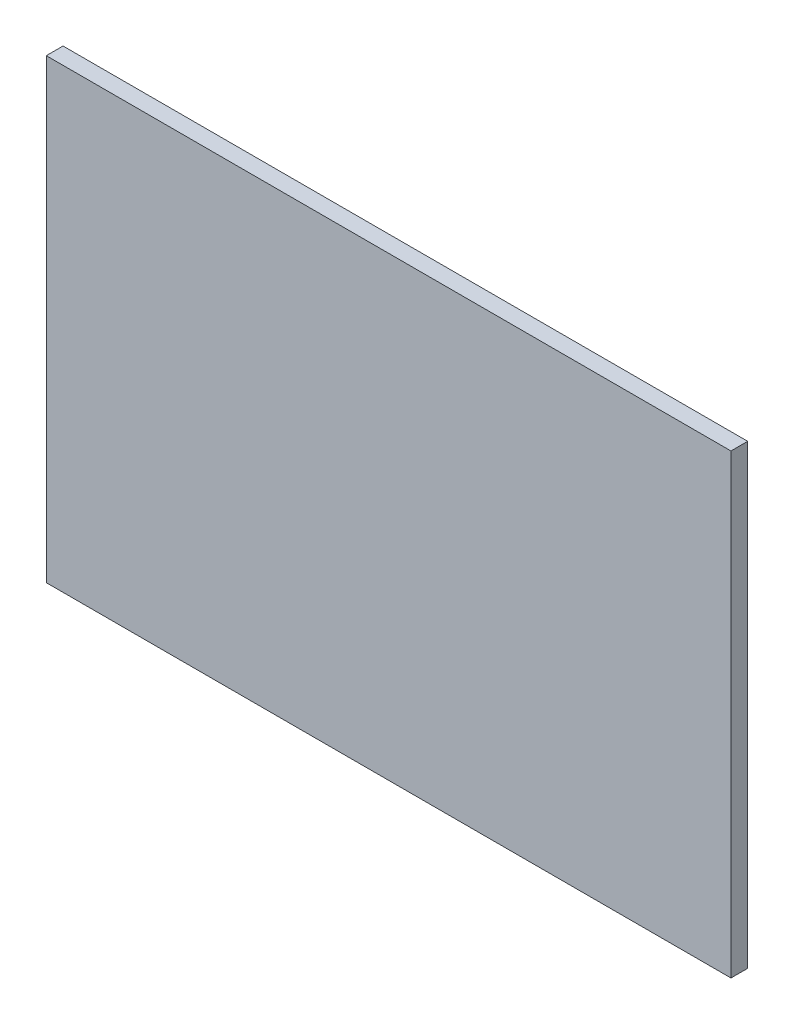
ISO-10303-21;
HEADER;
FILE_DESCRIPTION(('STEP AP214'),'2;1');
FILE_NAME('part.step','',(''),(''),'','','');
FILE_SCHEMA(('AUTOMOTIVE_DESIGN { 1 0 10303 214 1 1 1 1 }'));
ENDSEC;
DATA;
#1=APPLICATION_CONTEXT('core data for automotive mechanical design processes');
#2=APPLICATION_PROTOCOL_DEFINITION('international standard','automotive_design',2000,#1);
#3=PRODUCT_CONTEXT('',#1,'mechanical');
#4=PRODUCT('Part','Part','',(#3));
#5=PRODUCT_RELATED_PRODUCT_CATEGORY('part','',(#4));
#6=PRODUCT_DEFINITION_FORMATION('','',#4);
#7=PRODUCT_DEFINITION_CONTEXT('part definition',#1,'design');
#8=PRODUCT_DEFINITION('design','',#6,#7);
#9=PRODUCT_DEFINITION_SHAPE('','',#8);
#10=(LENGTH_UNIT() NAMED_UNIT(*) SI_UNIT(.MILLI.,.METRE.));
#11=(NAMED_UNIT(*) PLANE_ANGLE_UNIT() SI_UNIT($,.RADIAN.));
#12=(NAMED_UNIT(*) SI_UNIT($,.STERADIAN.) SOLID_ANGLE_UNIT());
#13=UNCERTAINTY_MEASURE_WITH_UNIT(LENGTH_MEASURE(1.E-05),#10,'distance_accuracy_value','');
#14=(GEOMETRIC_REPRESENTATION_CONTEXT(3) GLOBAL_UNCERTAINTY_ASSIGNED_CONTEXT((#13)) GLOBAL_UNIT_ASSIGNED_CONTEXT((#10,
#11,#12)) REPRESENTATION_CONTEXT('',''));
#15=CARTESIAN_POINT('',(0.,0.,0.));
#16=DIRECTION('',(0.,0.,1.));
#17=DIRECTION('',(1.,0.,0.));
#18=AXIS2_PLACEMENT_3D('',#15,#16,#17);
#19=CARTESIAN_POINT('',(22.5,-15.,1.1));
#20=DIRECTION('',(-1.,0.,0.));
#21=DIRECTION('',(0.,0.,1.));
#22=AXIS2_PLACEMENT_3D('',#19,#20,#21);
#23=PLANE('',#22);
#24=DIRECTION('',(0.,1.,0.));
#25=VECTOR('',#24,1.);
#26=CARTESIAN_POINT('',(22.5,-15.,0.));
#27=LINE('',#26,#25);
#28=CARTESIAN_POINT('',(22.5,-15.,0.));
#29=VERTEX_POINT('',#28);
#30=CARTESIAN_POINT('',(22.5,15.,0.));
#31=VERTEX_POINT('',#30);
#32=EDGE_CURVE('E107',#29,#31,#27,.T.);
#33=ORIENTED_EDGE('',*,*,#32,.T.);
#34=DIRECTION('',(0.,0.,-1.));
#35=VECTOR('',#34,1.);
#36=CARTESIAN_POINT('',(22.5,15.,1.1));
#37=LINE('',#36,#35);
#38=CARTESIAN_POINT('',(22.5,15.,1.1));
#39=VERTEX_POINT('',#38);
#40=EDGE_CURVE('E11',#39,#31,#37,.T.);
#41=ORIENTED_EDGE('',*,*,#40,.F.);
#42=DIRECTION('',(0.,1.,0.));
#43=VECTOR('',#42,1.);
#44=CARTESIAN_POINT('',(22.5,-15.,1.1));
#45=LINE('',#44,#43);
#46=CARTESIAN_POINT('',(22.5,-15.,1.1));
#47=VERTEX_POINT('',#46);
#48=EDGE_CURVE('E91',#47,#39,#45,.T.);
#49=ORIENTED_EDGE('',*,*,#48,.F.);
#50=DIRECTION('',(0.,0.,-1.));
#51=VECTOR('',#50,1.);
#52=CARTESIAN_POINT('',(22.5,-15.,1.1));
#53=LINE('',#52,#51);
#54=EDGE_CURVE('E103',#47,#29,#53,.T.);
#55=ORIENTED_EDGE('',*,*,#54,.T.);
#56=EDGE_LOOP('',(#33,#41,#49,#55));
#57=FACE_BOUND('',#56,.T.);
#58=ADVANCED_FACE('F39',(#57),#23,.F.);
#59=CARTESIAN_POINT('',(-22.5,15.,1.1));
#60=DIRECTION('',(0.,-1.,0.));
#61=DIRECTION('',(0.,0.,-1.));
#62=AXIS2_PLACEMENT_3D('',#59,#60,#61);
#63=PLANE('',#62);
#64=DIRECTION('',(-1.,0.,0.));
#65=VECTOR('',#64,1.);
#66=CARTESIAN_POINT('',(-22.5,15.,0.));
#67=LINE('',#66,#65);
#68=CARTESIAN_POINT('',(-22.5,15.,0.));
#69=VERTEX_POINT('',#68);
#70=EDGE_CURVE('E96',#31,#69,#67,.T.);
#71=ORIENTED_EDGE('',*,*,#70,.T.);
#72=DIRECTION('',(0.,0.,-1.));
#73=VECTOR('',#72,1.);
#74=CARTESIAN_POINT('',(-22.5,15.,1.1));
#75=LINE('',#74,#73);
#76=CARTESIAN_POINT('',(-22.5,15.,1.1));
#77=VERTEX_POINT('',#76);
#78=EDGE_CURVE('E48',#77,#69,#75,.T.);
#79=ORIENTED_EDGE('',*,*,#78,.F.);
#80=DIRECTION('',(-1.,0.,0.));
#81=VECTOR('',#80,1.);
#82=CARTESIAN_POINT('',(-22.5,15.,1.1));
#83=LINE('',#82,#81);
#84=EDGE_CURVE('E86',#39,#77,#83,.T.);
#85=ORIENTED_EDGE('',*,*,#84,.F.);
#86=ORIENTED_EDGE('',*,*,#40,.T.);
#87=EDGE_LOOP('',(#71,#79,#85,#86));
#88=FACE_BOUND('',#87,.T.);
#89=ADVANCED_FACE('F95',(#88),#63,.F.);
#90=CARTESIAN_POINT('',(-22.5,-15.,1.1));
#91=DIRECTION('',(1.,0.,0.));
#92=DIRECTION('',(0.,0.,-1.));
#93=AXIS2_PLACEMENT_3D('',#90,#91,#92);
#94=PLANE('',#93);
#95=DIRECTION('',(0.,-1.,0.));
#96=VECTOR('',#95,1.);
#97=CARTESIAN_POINT('',(-22.5,-15.,0.));
#98=LINE('',#97,#96);
#99=CARTESIAN_POINT('',(-22.5,-15.,0.));
#100=VERTEX_POINT('',#99);
#101=EDGE_CURVE('E73',#69,#100,#98,.T.);
#102=ORIENTED_EDGE('',*,*,#101,.T.);
#103=DIRECTION('',(0.,0.,-1.));
#104=VECTOR('',#103,1.);
#105=CARTESIAN_POINT('',(-22.5,-15.,1.1));
#106=LINE('',#105,#104);
#107=CARTESIAN_POINT('',(-22.5,-15.,1.1));
#108=VERTEX_POINT('',#107);
#109=EDGE_CURVE('E98',#108,#100,#106,.T.);
#110=ORIENTED_EDGE('',*,*,#109,.F.);
#111=DIRECTION('',(0.,-1.,0.));
#112=VECTOR('',#111,1.);
#113=CARTESIAN_POINT('',(-22.5,-15.,1.1));
#114=LINE('',#113,#112);
#115=EDGE_CURVE('E89',#77,#108,#114,.T.);
#116=ORIENTED_EDGE('',*,*,#115,.F.);
#117=ORIENTED_EDGE('',*,*,#78,.T.);
#118=EDGE_LOOP('',(#102,#110,#116,#117));
#119=FACE_BOUND('',#118,.T.);
#120=ADVANCED_FACE('F99',(#119),#94,.F.);
#121=CARTESIAN_POINT('',(-22.5,-15.,1.1));
#122=DIRECTION('',(0.,1.,0.));
#123=DIRECTION('',(0.,0.,1.));
#124=AXIS2_PLACEMENT_3D('',#121,#122,#123);
#125=PLANE('',#124);
#126=DIRECTION('',(1.,0.,0.));
#127=VECTOR('',#126,1.);
#128=CARTESIAN_POINT('',(-22.5,-15.,0.));
#129=LINE('',#128,#127);
#130=EDGE_CURVE('E79',#100,#29,#129,.T.);
#131=ORIENTED_EDGE('',*,*,#130,.T.);
#132=ORIENTED_EDGE('',*,*,#54,.F.);
#133=DIRECTION('',(1.,0.,0.));
#134=VECTOR('',#133,1.);
#135=CARTESIAN_POINT('',(-22.5,-15.,1.1));
#136=LINE('',#135,#134);
#137=EDGE_CURVE('E56',#108,#47,#136,.T.);
#138=ORIENTED_EDGE('',*,*,#137,.F.);
#139=ORIENTED_EDGE('',*,*,#109,.T.);
#140=EDGE_LOOP('',(#131,#132,#138,#139));
#141=FACE_BOUND('',#140,.T.);
#142=ADVANCED_FACE('F120',(#141),#125,.F.);
#143=CARTESIAN_POINT('',(0.,0.,1.1));
#144=DIRECTION('',(0.,0.,-1.));
#145=DIRECTION('',(-1.,0.,0.));
#146=AXIS2_PLACEMENT_3D('',#143,#144,#145);
#147=PLANE('',#146);
#148=ORIENTED_EDGE('',*,*,#48,.T.);
#149=ORIENTED_EDGE('',*,*,#84,.T.);
#150=ORIENTED_EDGE('',*,*,#115,.T.);
#151=ORIENTED_EDGE('',*,*,#137,.T.);
#152=EDGE_LOOP('',(#148,#149,#150,#151));
#153=FACE_BOUND('',#152,.T.);
#154=ADVANCED_FACE('F87',(#153),#147,.F.);
#155=CARTESIAN_POINT('',(0.,0.,0.));
#156=DIRECTION('',(0.,0.,-1.));
#157=DIRECTION('',(-1.,0.,0.));
#158=AXIS2_PLACEMENT_3D('',#155,#156,#157);
#159=PLANE('',#158);
#160=ORIENTED_EDGE('',*,*,#32,.F.);
#161=ORIENTED_EDGE('',*,*,#130,.F.);
#162=ORIENTED_EDGE('',*,*,#101,.F.);
#163=ORIENTED_EDGE('',*,*,#70,.F.);
#164=EDGE_LOOP('',(#160,#161,#162,#163));
#165=FACE_BOUND('',#164,.T.);
#166=ADVANCED_FACE('F123',(#165),#159,.T.);
#167=CLOSED_SHELL('',(#58,#89,#120,#142,#154,#166));
#168=MANIFOLD_SOLID_BREP('B2',#167);
#169=ADVANCED_BREP_SHAPE_REPRESENTATION('',(#18,#168),#14);
#170=SHAPE_DEFINITION_REPRESENTATION(#9,#169);
ENDSEC;
END-ISO-10303-21;
